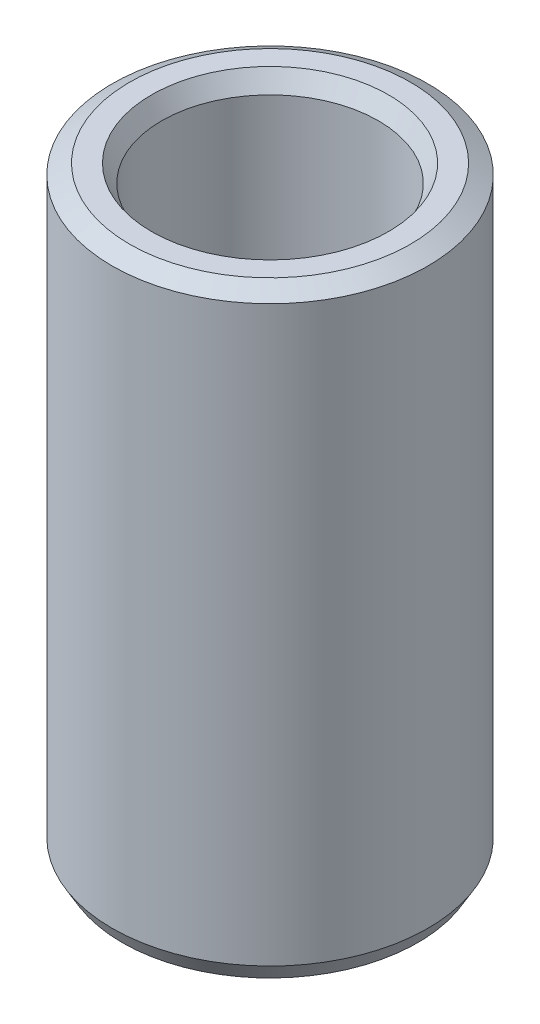
ISO-10303-21;
HEADER;
FILE_DESCRIPTION(('STEP AP214'),'2;1');
FILE_NAME('part.step','',(''),(''),'','','');
FILE_SCHEMA(('AUTOMOTIVE_DESIGN { 1 0 10303 214 1 1 1 1 }'));
ENDSEC;
DATA;
#1=APPLICATION_CONTEXT('core data for automotive mechanical design processes');
#2=APPLICATION_PROTOCOL_DEFINITION('international standard','automotive_design',2000,#1);
#3=PRODUCT_CONTEXT('',#1,'mechanical');
#4=PRODUCT('Part','Part','',(#3));
#5=PRODUCT_RELATED_PRODUCT_CATEGORY('part','',(#4));
#6=PRODUCT_DEFINITION_FORMATION('','',#4);
#7=PRODUCT_DEFINITION_CONTEXT('part definition',#1,'design');
#8=PRODUCT_DEFINITION('design','',#6,#7);
#9=PRODUCT_DEFINITION_SHAPE('','',#8);
#10=(LENGTH_UNIT() NAMED_UNIT(*) SI_UNIT(.MILLI.,.METRE.));
#11=(NAMED_UNIT(*) PLANE_ANGLE_UNIT() SI_UNIT($,.RADIAN.));
#12=(NAMED_UNIT(*) SI_UNIT($,.STERADIAN.) SOLID_ANGLE_UNIT());
#13=UNCERTAINTY_MEASURE_WITH_UNIT(LENGTH_MEASURE(1.E-05),#10,'distance_accuracy_value','');
#14=(GEOMETRIC_REPRESENTATION_CONTEXT(3) GLOBAL_UNCERTAINTY_ASSIGNED_CONTEXT((#13)) GLOBAL_UNIT_ASSIGNED_CONTEXT((#10,
#11,#12)) REPRESENTATION_CONTEXT('',''));
#15=CARTESIAN_POINT('',(0.,0.,0.));
#16=DIRECTION('',(0.,0.,1.));
#17=DIRECTION('',(1.,0.,0.));
#18=AXIS2_PLACEMENT_3D('',#15,#16,#17);
#19=CARTESIAN_POINT('',(0.,190.385845028535,0.));
#20=DIRECTION('',(0.,-1.,0.));
#21=DIRECTION('',(0.,0.,-1.));
#22=AXIS2_PLACEMENT_3D('',#19,#20,#21);
#23=CYLINDRICAL_SURFACE('',#22,50.);
#24=CARTESIAN_POINT('',(0.,5.53326464144982,0.));
#25=DIRECTION('',(0.,1.,0.));
#26=DIRECTION('',(0.,0.,1.));
#27=AXIS2_PLACEMENT_3D('',#24,#25,#26);
#28=CIRCLE('',#27,50.);
#29=CARTESIAN_POINT('',(0.,5.53326464144982,50.));
#30=VERTEX_POINT('',#29);
#31=EDGE_CURVE('E10',#30,#30,#28,.T.);
#32=ORIENTED_EDGE('',*,*,#31,.T.);
#33=EDGE_LOOP('',(#32));
#34=FACE_BOUND('',#33,.T.);
#35=CARTESIAN_POINT('',(0.,187.191213198296,0.));
#36=DIRECTION('',(0.,1.,0.));
#37=DIRECTION('',(0.,0.,1.));
#38=AXIS2_PLACEMENT_3D('',#35,#36,#37);
#39=CIRCLE('',#38,50.);
#40=CARTESIAN_POINT('',(0.,187.191213198296,50.));
#41=VERTEX_POINT('',#40);
#42=EDGE_CURVE('E50',#41,#41,#39,.F.);
#43=ORIENTED_EDGE('',*,*,#42,.T.);
#44=EDGE_LOOP('',(#43));
#45=FACE_BOUND('',#44,.T.);
#46=ADVANCED_FACE('F39',(#34,#45),#23,.T.);
#47=CARTESIAN_POINT('',(0.,190.385845028535,0.));
#48=DIRECTION('',(0.,1.,0.));
#49=DIRECTION('',(0.,0.,1.));
#50=AXIS2_PLACEMENT_3D('',#47,#48,#49);
#51=PLANE('',#50);
#52=CARTESIAN_POINT('',(0.,190.385845028535,0.));
#53=DIRECTION('',(0.,1.,0.));
#54=DIRECTION('',(0.,0.,1.));
#55=AXIS2_PLACEMENT_3D('',#52,#53,#54);
#56=CIRCLE('',#55,37.5323304494557);
#57=CARTESIAN_POINT('',(0.,190.385845028535,37.5323304494557));
#58=VERTEX_POINT('',#57);
#59=EDGE_CURVE('E58',#58,#58,#56,.F.);
#60=ORIENTED_EDGE('',*,*,#59,.T.);
#61=EDGE_LOOP('',(#60));
#62=FACE_BOUND('',#61,.T.);
#63=CARTESIAN_POINT('',(0.,190.385845028535,0.));
#64=DIRECTION('',(0.,1.,0.));
#65=DIRECTION('',(0.,0.,1.));
#66=AXIS2_PLACEMENT_3D('',#63,#64,#65);
#67=CIRCLE('',#66,44.4667353585502);
#68=CARTESIAN_POINT('',(0.,190.385845028535,44.4667353585502));
#69=VERTEX_POINT('',#68);
#70=EDGE_CURVE('E61',#69,#69,#67,.T.);
#71=ORIENTED_EDGE('',*,*,#70,.T.);
#72=EDGE_LOOP('',(#71));
#73=FACE_BOUND('',#72,.T.);
#74=ADVANCED_FACE('F88',(#62,#73),#51,.T.);
#75=CARTESIAN_POINT('',(0.,0.,0.));
#76=DIRECTION('',(0.,1.,0.));
#77=DIRECTION('',(0.,0.,1.));
#78=AXIS2_PLACEMENT_3D('',#75,#76,#77);
#79=PLANE('',#78);
#80=CARTESIAN_POINT('',(0.,0.,0.));
#81=DIRECTION('',(0.,1.,0.));
#82=DIRECTION('',(0.,0.,1.));
#83=AXIS2_PLACEMENT_3D('',#80,#81,#82);
#84=CIRCLE('',#83,39.870963260667);
#85=CARTESIAN_POINT('',(0.,0.,39.870963260667));
#86=VERTEX_POINT('',#85);
#87=EDGE_CURVE('E51',#86,#86,#84,.T.);
#88=ORIENTED_EDGE('',*,*,#87,.T.);
#89=EDGE_LOOP('',(#88));
#90=FACE_BOUND('',#89,.T.);
#91=CARTESIAN_POINT('',(0.,0.,0.));
#92=DIRECTION('',(0.,1.,0.));
#93=DIRECTION('',(0.,0.,1.));
#94=AXIS2_PLACEMENT_3D('',#91,#92,#93);
#95=CIRCLE('',#94,46.8053681697615);
#96=CARTESIAN_POINT('',(0.,0.,46.8053681697615));
#97=VERTEX_POINT('',#96);
#98=EDGE_CURVE('E54',#97,#97,#95,.F.);
#99=ORIENTED_EDGE('',*,*,#98,.T.);
#100=EDGE_LOOP('',(#99));
#101=FACE_BOUND('',#100,.T.);
#102=ADVANCED_FACE('F83',(#90,#101),#79,.F.);
#103=CARTESIAN_POINT('',(0.,190.385845028535,0.));
#104=DIRECTION('',(0.,-1.,0.));
#105=DIRECTION('',(0.,0.,-1.));
#106=AXIS2_PLACEMENT_3D('',#103,#104,#105);
#107=CYLINDRICAL_SURFACE('',#106,34.3376986192173);
#108=CARTESIAN_POINT('',(0.,184.852580387085,0.));
#109=DIRECTION('',(0.,1.,0.));
#110=DIRECTION('',(0.,0.,1.));
#111=AXIS2_PLACEMENT_3D('',#108,#109,#110);
#112=CIRCLE('',#111,34.3376986192173);
#113=CARTESIAN_POINT('',(0.,184.852580387085,34.3376986192173));
#114=VERTEX_POINT('',#113);
#115=EDGE_CURVE('E67',#114,#114,#112,.T.);
#116=ORIENTED_EDGE('',*,*,#115,.T.);
#117=EDGE_LOOP('',(#116));
#118=FACE_BOUND('',#117,.T.);
#119=CARTESIAN_POINT('',(0.,3.19463183023849,0.));
#120=DIRECTION('',(0.,1.,0.));
#121=DIRECTION('',(0.,0.,1.));
#122=AXIS2_PLACEMENT_3D('',#119,#120,#121);
#123=CIRCLE('',#122,34.3376986192173);
#124=CARTESIAN_POINT('',(0.,3.19463183023849,34.3376986192173));
#125=VERTEX_POINT('',#124);
#126=EDGE_CURVE('E69',#125,#125,#123,.F.);
#127=ORIENTED_EDGE('',*,*,#126,.T.);
#128=EDGE_LOOP('',(#127));
#129=FACE_BOUND('',#128,.T.);
#130=ADVANCED_FACE('F71',(#118,#129),#107,.F.);
#131=CARTESIAN_POINT('',(0.,184.852580387085,0.));
#132=DIRECTION('',(0.,1.,0.));
#133=DIRECTION('',(0.,0.,1.));
#134=AXIS2_PLACEMENT_3D('',#131,#132,#133);
#135=CONICAL_SURFACE('',#134,34.3376986192173,0.523598775598297);
#136=ORIENTED_EDGE('',*,*,#59,.F.);
#137=EDGE_LOOP('',(#136));
#138=FACE_BOUND('',#137,.T.);
#139=ORIENTED_EDGE('',*,*,#115,.F.);
#140=EDGE_LOOP('',(#139));
#141=FACE_BOUND('',#140,.T.);
#142=ADVANCED_FACE('F77',(#138,#141),#135,.F.);
#143=CARTESIAN_POINT('',(0.,0.,0.));
#144=DIRECTION('',(0.,-1.,0.));
#145=DIRECTION('',(0.,0.,-1.));
#146=AXIS2_PLACEMENT_3D('',#143,#144,#145);
#147=CONICAL_SURFACE('',#146,39.870963260667,1.04719755119659);
#148=ORIENTED_EDGE('',*,*,#126,.F.);
#149=EDGE_LOOP('',(#148));
#150=FACE_BOUND('',#149,.T.);
#151=ORIENTED_EDGE('',*,*,#87,.F.);
#152=EDGE_LOOP('',(#151));
#153=FACE_BOUND('',#152,.T.);
#154=ADVANCED_FACE('F73',(#150,#153),#147,.F.);
#155=CARTESIAN_POINT('',(0.,5.53326464144982,0.));
#156=DIRECTION('',(0.,1.,0.));
#157=DIRECTION('',(0.,0.,1.));
#158=AXIS2_PLACEMENT_3D('',#155,#156,#157);
#159=CONICAL_SURFACE('',#158,50.,0.523598775598301);
#160=ORIENTED_EDGE('',*,*,#98,.F.);
#161=EDGE_LOOP('',(#160));
#162=FACE_BOUND('',#161,.T.);
#163=ORIENTED_EDGE('',*,*,#31,.F.);
#164=EDGE_LOOP('',(#163));
#165=FACE_BOUND('',#164,.T.);
#166=ADVANCED_FACE('F76',(#162,#165),#159,.T.);
#167=CARTESIAN_POINT('',(0.,190.385845028535,0.));
#168=DIRECTION('',(0.,-1.,0.));
#169=DIRECTION('',(0.,0.,-1.));
#170=AXIS2_PLACEMENT_3D('',#167,#168,#169);
#171=CONICAL_SURFACE('',#170,44.4667353585502,1.04719755119659);
#172=ORIENTED_EDGE('',*,*,#42,.F.);
#173=EDGE_LOOP('',(#172));
#174=FACE_BOUND('',#173,.T.);
#175=ORIENTED_EDGE('',*,*,#70,.F.);
#176=EDGE_LOOP('',(#175));
#177=FACE_BOUND('',#176,.T.);
#178=ADVANCED_FACE('F45',(#174,#177),#171,.T.);
#179=CLOSED_SHELL('',(#46,#74,#102,#130,#142,#154,#166,#178));
#180=MANIFOLD_SOLID_BREP('B2',#179);
#181=ADVANCED_BREP_SHAPE_REPRESENTATION('',(#18,#180),#14);
#182=SHAPE_DEFINITION_REPRESENTATION(#9,#181);
ENDSEC;
END-ISO-10303-21;
